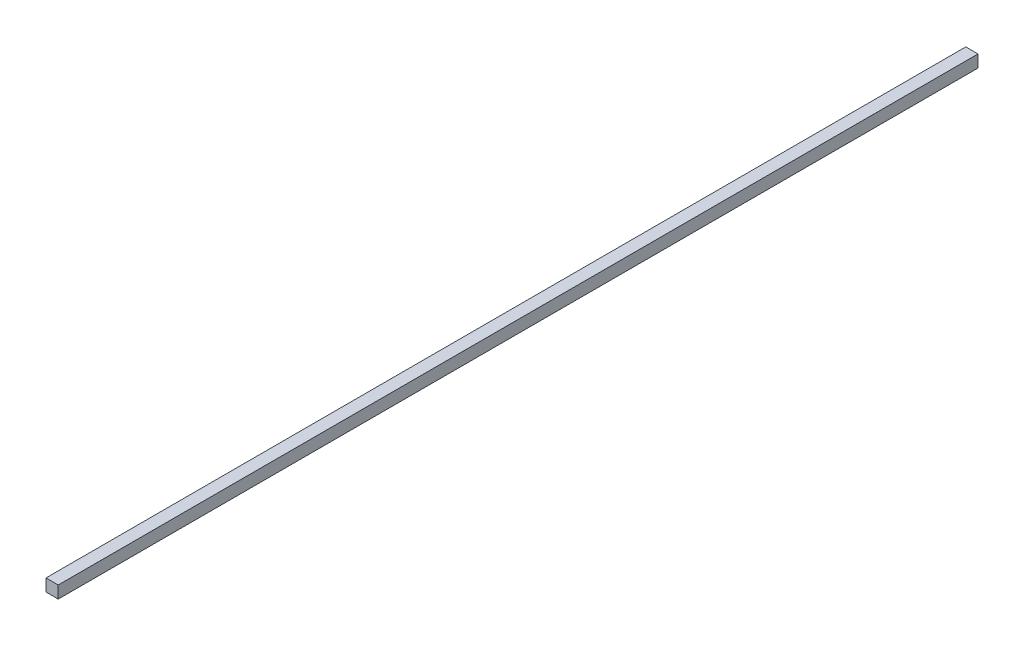
ISO-10303-21;
HEADER;
FILE_DESCRIPTION(('STEP AP214'),'2;1');
FILE_NAME('part.step','',(''),(''),'','','');
FILE_SCHEMA(('AUTOMOTIVE_DESIGN { 1 0 10303 214 1 1 1 1 }'));
ENDSEC;
DATA;
#1=APPLICATION_CONTEXT('core data for automotive mechanical design processes');
#2=APPLICATION_PROTOCOL_DEFINITION('international standard','automotive_design',2000,#1);
#3=PRODUCT_CONTEXT('',#1,'mechanical');
#4=PRODUCT('Part','Part','',(#3));
#5=PRODUCT_RELATED_PRODUCT_CATEGORY('part','',(#4));
#6=PRODUCT_DEFINITION_FORMATION('','',#4);
#7=PRODUCT_DEFINITION_CONTEXT('part definition',#1,'design');
#8=PRODUCT_DEFINITION('design','',#6,#7);
#9=PRODUCT_DEFINITION_SHAPE('','',#8);
#10=(LENGTH_UNIT() NAMED_UNIT(*) SI_UNIT(.MILLI.,.METRE.));
#11=(NAMED_UNIT(*) PLANE_ANGLE_UNIT() SI_UNIT($,.RADIAN.));
#12=(NAMED_UNIT(*) SI_UNIT($,.STERADIAN.) SOLID_ANGLE_UNIT());
#13=UNCERTAINTY_MEASURE_WITH_UNIT(LENGTH_MEASURE(1.E-05),#10,'distance_accuracy_value','');
#14=(GEOMETRIC_REPRESENTATION_CONTEXT(3) GLOBAL_UNCERTAINTY_ASSIGNED_CONTEXT((#13)) GLOBAL_UNIT_ASSIGNED_CONTEXT((#10,
#11,#12)) REPRESENTATION_CONTEXT('',''));
#15=CARTESIAN_POINT('',(0.,0.,0.));
#16=DIRECTION('',(0.,0.,1.));
#17=DIRECTION('',(1.,0.,0.));
#18=AXIS2_PLACEMENT_3D('',#15,#16,#17);
#19=CARTESIAN_POINT('',(-1.6891,-1.6891,254.));
#20=DIRECTION('',(1.,0.,0.));
#21=DIRECTION('',(0.,0.,-1.));
#22=AXIS2_PLACEMENT_3D('',#19,#20,#21);
#23=PLANE('',#22);
#24=DIRECTION('',(0.,-1.,0.));
#25=VECTOR('',#24,1.);
#26=CARTESIAN_POINT('',(-1.6891,-1.6891,0.));
#27=LINE('',#26,#25);
#28=CARTESIAN_POINT('',(-1.6891,1.6891,0.));
#29=VERTEX_POINT('',#28);
#30=CARTESIAN_POINT('',(-1.6891,-1.6891,0.));
#31=VERTEX_POINT('',#30);
#32=EDGE_CURVE('E107',#29,#31,#27,.T.);
#33=ORIENTED_EDGE('',*,*,#32,.T.);
#34=DIRECTION('',(0.,0.,-1.));
#35=VECTOR('',#34,1.);
#36=CARTESIAN_POINT('',(-1.6891,-1.6891,254.));
#37=LINE('',#36,#35);
#38=CARTESIAN_POINT('',(-1.6891,-1.6891,254.));
#39=VERTEX_POINT('',#38);
#40=EDGE_CURVE('E11',#39,#31,#37,.T.);
#41=ORIENTED_EDGE('',*,*,#40,.F.);
#42=DIRECTION('',(0.,-1.,0.));
#43=VECTOR('',#42,1.);
#44=CARTESIAN_POINT('',(-1.6891,-1.6891,254.));
#45=LINE('',#44,#43);
#46=CARTESIAN_POINT('',(-1.6891,1.6891,254.));
#47=VERTEX_POINT('',#46);
#48=EDGE_CURVE('E91',#47,#39,#45,.T.);
#49=ORIENTED_EDGE('',*,*,#48,.F.);
#50=DIRECTION('',(0.,0.,-1.));
#51=VECTOR('',#50,1.);
#52=CARTESIAN_POINT('',(-1.6891,1.6891,254.));
#53=LINE('',#52,#51);
#54=EDGE_CURVE('E103',#47,#29,#53,.T.);
#55=ORIENTED_EDGE('',*,*,#54,.T.);
#56=EDGE_LOOP('',(#33,#41,#49,#55));
#57=FACE_BOUND('',#56,.T.);
#58=ADVANCED_FACE('F39',(#57),#23,.F.);
#59=CARTESIAN_POINT('',(-1.6891,-1.6891,254.));
#60=DIRECTION('',(0.,1.,0.));
#61=DIRECTION('',(0.,0.,1.));
#62=AXIS2_PLACEMENT_3D('',#59,#60,#61);
#63=PLANE('',#62);
#64=DIRECTION('',(1.,0.,0.));
#65=VECTOR('',#64,1.);
#66=CARTESIAN_POINT('',(-1.6891,-1.6891,0.));
#67=LINE('',#66,#65);
#68=CARTESIAN_POINT('',(1.6891,-1.6891,0.));
#69=VERTEX_POINT('',#68);
#70=EDGE_CURVE('E96',#31,#69,#67,.T.);
#71=ORIENTED_EDGE('',*,*,#70,.T.);
#72=DIRECTION('',(0.,0.,-1.));
#73=VECTOR('',#72,1.);
#74=CARTESIAN_POINT('',(1.6891,-1.6891,254.));
#75=LINE('',#74,#73);
#76=CARTESIAN_POINT('',(1.6891,-1.6891,254.));
#77=VERTEX_POINT('',#76);
#78=EDGE_CURVE('E48',#77,#69,#75,.T.);
#79=ORIENTED_EDGE('',*,*,#78,.F.);
#80=DIRECTION('',(1.,0.,0.));
#81=VECTOR('',#80,1.);
#82=CARTESIAN_POINT('',(-1.6891,-1.6891,254.));
#83=LINE('',#82,#81);
#84=EDGE_CURVE('E86',#39,#77,#83,.T.);
#85=ORIENTED_EDGE('',*,*,#84,.F.);
#86=ORIENTED_EDGE('',*,*,#40,.T.);
#87=EDGE_LOOP('',(#71,#79,#85,#86));
#88=FACE_BOUND('',#87,.T.);
#89=ADVANCED_FACE('F95',(#88),#63,.F.);
#90=CARTESIAN_POINT('',(1.6891,-1.6891,254.));
#91=DIRECTION('',(-1.,0.,0.));
#92=DIRECTION('',(0.,-1.,0.));
#93=AXIS2_PLACEMENT_3D('',#90,#91,#92);
#94=PLANE('',#93);
#95=DIRECTION('',(0.,1.,0.));
#96=VECTOR('',#95,1.);
#97=CARTESIAN_POINT('',(1.6891,-1.6891,0.));
#98=LINE('',#97,#96);
#99=CARTESIAN_POINT('',(1.6891,1.6891,0.));
#100=VERTEX_POINT('',#99);
#101=EDGE_CURVE('E73',#69,#100,#98,.T.);
#102=ORIENTED_EDGE('',*,*,#101,.T.);
#103=DIRECTION('',(0.,0.,-1.));
#104=VECTOR('',#103,1.);
#105=CARTESIAN_POINT('',(1.6891,1.6891,254.));
#106=LINE('',#105,#104);
#107=CARTESIAN_POINT('',(1.6891,1.6891,254.));
#108=VERTEX_POINT('',#107);
#109=EDGE_CURVE('E98',#108,#100,#106,.T.);
#110=ORIENTED_EDGE('',*,*,#109,.F.);
#111=DIRECTION('',(0.,1.,0.));
#112=VECTOR('',#111,1.);
#113=CARTESIAN_POINT('',(1.6891,-1.6891,254.));
#114=LINE('',#113,#112);
#115=EDGE_CURVE('E89',#77,#108,#114,.T.);
#116=ORIENTED_EDGE('',*,*,#115,.F.);
#117=ORIENTED_EDGE('',*,*,#78,.T.);
#118=EDGE_LOOP('',(#102,#110,#116,#117));
#119=FACE_BOUND('',#118,.T.);
#120=ADVANCED_FACE('F99',(#119),#94,.F.);
#121=CARTESIAN_POINT('',(-1.6891,1.6891,254.));
#122=DIRECTION('',(0.,-1.,0.));
#123=DIRECTION('',(1.,0.,0.));
#124=AXIS2_PLACEMENT_3D('',#121,#122,#123);
#125=PLANE('',#124);
#126=DIRECTION('',(-1.,0.,0.));
#127=VECTOR('',#126,1.);
#128=CARTESIAN_POINT('',(-1.6891,1.6891,0.));
#129=LINE('',#128,#127);
#130=EDGE_CURVE('E79',#100,#29,#129,.T.);
#131=ORIENTED_EDGE('',*,*,#130,.T.);
#132=ORIENTED_EDGE('',*,*,#54,.F.);
#133=DIRECTION('',(-1.,0.,0.));
#134=VECTOR('',#133,1.);
#135=CARTESIAN_POINT('',(-1.6891,1.6891,254.));
#136=LINE('',#135,#134);
#137=EDGE_CURVE('E56',#108,#47,#136,.T.);
#138=ORIENTED_EDGE('',*,*,#137,.F.);
#139=ORIENTED_EDGE('',*,*,#109,.T.);
#140=EDGE_LOOP('',(#131,#132,#138,#139));
#141=FACE_BOUND('',#140,.T.);
#142=ADVANCED_FACE('F120',(#141),#125,.F.);
#143=CARTESIAN_POINT('',(0.,0.,254.));
#144=DIRECTION('',(0.,0.,-1.));
#145=DIRECTION('',(-1.,0.,0.));
#146=AXIS2_PLACEMENT_3D('',#143,#144,#145);
#147=PLANE('',#146);
#148=ORIENTED_EDGE('',*,*,#48,.T.);
#149=ORIENTED_EDGE('',*,*,#84,.T.);
#150=ORIENTED_EDGE('',*,*,#115,.T.);
#151=ORIENTED_EDGE('',*,*,#137,.T.);
#152=EDGE_LOOP('',(#148,#149,#150,#151));
#153=FACE_BOUND('',#152,.T.);
#154=ADVANCED_FACE('F87',(#153),#147,.F.);
#155=CARTESIAN_POINT('',(0.,0.,0.));
#156=DIRECTION('',(0.,0.,-1.));
#157=DIRECTION('',(-1.,0.,0.));
#158=AXIS2_PLACEMENT_3D('',#155,#156,#157);
#159=PLANE('',#158);
#160=ORIENTED_EDGE('',*,*,#32,.F.);
#161=ORIENTED_EDGE('',*,*,#130,.F.);
#162=ORIENTED_EDGE('',*,*,#101,.F.);
#163=ORIENTED_EDGE('',*,*,#70,.F.);
#164=EDGE_LOOP('',(#160,#161,#162,#163));
#165=FACE_BOUND('',#164,.T.);
#166=ADVANCED_FACE('F123',(#165),#159,.T.);
#167=CLOSED_SHELL('',(#58,#89,#120,#142,#154,#166));
#168=MANIFOLD_SOLID_BREP('B2',#167);
#169=ADVANCED_BREP_SHAPE_REPRESENTATION('',(#18,#168),#14);
#170=SHAPE_DEFINITION_REPRESENTATION(#9,#169);
ENDSEC;
END-ISO-10303-21;
